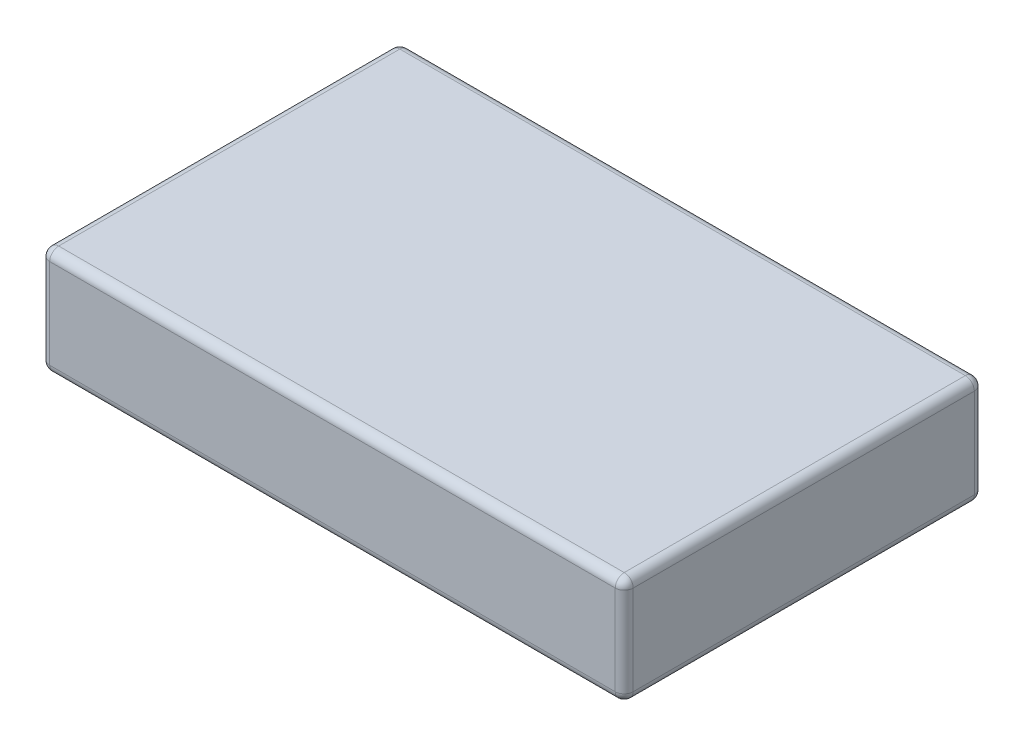
ISO-10303-21;
HEADER;
FILE_DESCRIPTION(('STEP AP214'),'2;1');
FILE_NAME('part.step','',(''),(''),'','','');
FILE_SCHEMA(('AUTOMOTIVE_DESIGN { 1 0 10303 214 1 1 1 1 }'));
ENDSEC;
DATA;
#1=APPLICATION_CONTEXT('core data for automotive mechanical design processes');
#2=APPLICATION_PROTOCOL_DEFINITION('international standard','automotive_design',2000,#1);
#3=PRODUCT_CONTEXT('',#1,'mechanical');
#4=PRODUCT('Part','Part','',(#3));
#5=PRODUCT_RELATED_PRODUCT_CATEGORY('part','',(#4));
#6=PRODUCT_DEFINITION_FORMATION('','',#4);
#7=PRODUCT_DEFINITION_CONTEXT('part definition',#1,'design');
#8=PRODUCT_DEFINITION('design','',#6,#7);
#9=PRODUCT_DEFINITION_SHAPE('','',#8);
#10=(LENGTH_UNIT() NAMED_UNIT(*) SI_UNIT(.MILLI.,.METRE.));
#11=(NAMED_UNIT(*) PLANE_ANGLE_UNIT() SI_UNIT($,.RADIAN.));
#12=(NAMED_UNIT(*) SI_UNIT($,.STERADIAN.) SOLID_ANGLE_UNIT());
#13=UNCERTAINTY_MEASURE_WITH_UNIT(LENGTH_MEASURE(1.E-05),#10,'distance_accuracy_value','');
#14=(GEOMETRIC_REPRESENTATION_CONTEXT(3) GLOBAL_UNCERTAINTY_ASSIGNED_CONTEXT((#13)) GLOBAL_UNIT_ASSIGNED_CONTEXT((#10,
#11,#12)) REPRESENTATION_CONTEXT('',''));
#15=CARTESIAN_POINT('',(0.,0.,0.));
#16=DIRECTION('',(0.,0.,1.));
#17=DIRECTION('',(1.,0.,0.));
#18=AXIS2_PLACEMENT_3D('',#15,#16,#17);
#19=CARTESIAN_POINT('',(0.,12.,0.));
#20=DIRECTION('',(1.,0.,0.));
#21=DIRECTION('',(0.,0.,-1.));
#22=AXIS2_PLACEMENT_3D('',#19,#20,#21);
#23=PLANE('',#22);
#24=DIRECTION('',(0.,-1.,0.));
#25=VECTOR('',#24,1.);
#26=CARTESIAN_POINT('',(0.,12.,-39.));
#27=LINE('',#26,#25);
#28=CARTESIAN_POINT('',(0.,11.,-39.));
#29=VERTEX_POINT('',#28);
#30=CARTESIAN_POINT('',(0.,1.,-39.));
#31=VERTEX_POINT('',#30);
#32=EDGE_CURVE('E159',#29,#31,#27,.T.);
#33=ORIENTED_EDGE('',*,*,#32,.T.);
#34=DIRECTION('',(0.,0.,1.));
#35=VECTOR('',#34,1.);
#36=CARTESIAN_POINT('',(0.,1.,0.));
#37=LINE('',#36,#35);
#38=CARTESIAN_POINT('',(0.,1.,-1.));
#39=VERTEX_POINT('',#38);
#40=EDGE_CURVE('E132',#31,#39,#37,.T.);
#41=ORIENTED_EDGE('',*,*,#40,.T.);
#42=DIRECTION('',(0.,-1.,0.));
#43=VECTOR('',#42,1.);
#44=CARTESIAN_POINT('',(0.,12.,-1.));
#45=LINE('',#44,#43);
#46=CARTESIAN_POINT('',(0.,11.,-1.));
#47=VERTEX_POINT('',#46);
#48=EDGE_CURVE('E150',#39,#47,#45,.F.);
#49=ORIENTED_EDGE('',*,*,#48,.T.);
#50=DIRECTION('',(0.,0.,1.));
#51=VECTOR('',#50,1.);
#52=CARTESIAN_POINT('',(0.,11.,0.));
#53=LINE('',#52,#51);
#54=EDGE_CURVE('E156',#47,#29,#53,.F.);
#55=ORIENTED_EDGE('',*,*,#54,.T.);
#56=EDGE_LOOP('',(#33,#41,#49,#55));
#57=FACE_BOUND('',#56,.T.);
#58=ADVANCED_FACE('F38',(#57),#23,.F.);
#59=CARTESIAN_POINT('',(0.,12.,0.));
#60=DIRECTION('',(0.,0.,-1.));
#61=DIRECTION('',(-1.,0.,0.));
#62=AXIS2_PLACEMENT_3D('',#59,#60,#61);
#63=PLANE('',#62);
#64=DIRECTION('',(1.,0.,0.));
#65=VECTOR('',#64,1.);
#66=CARTESIAN_POINT('',(0.,11.,0.));
#67=LINE('',#66,#65);
#68=CARTESIAN_POINT('',(64.,11.,0.));
#69=VERTEX_POINT('',#68);
#70=CARTESIAN_POINT('',(1.,11.,0.));
#71=VERTEX_POINT('',#70);
#72=EDGE_CURVE('E47',#69,#71,#67,.F.);
#73=ORIENTED_EDGE('',*,*,#72,.T.);
#74=DIRECTION('',(0.,-1.,0.));
#75=VECTOR('',#74,1.);
#76=CARTESIAN_POINT('',(1.,12.,0.));
#77=LINE('',#76,#75);
#78=CARTESIAN_POINT('',(1.,1.,0.));
#79=VERTEX_POINT('',#78);
#80=EDGE_CURVE('E11',#71,#79,#77,.T.);
#81=ORIENTED_EDGE('',*,*,#80,.T.);
#82=DIRECTION('',(1.,0.,0.));
#83=VECTOR('',#82,1.);
#84=CARTESIAN_POINT('',(65.,1.,0.));
#85=LINE('',#84,#83);
#86=CARTESIAN_POINT('',(64.,1.,0.));
#87=VERTEX_POINT('',#86);
#88=EDGE_CURVE('E199',#79,#87,#85,.T.);
#89=ORIENTED_EDGE('',*,*,#88,.T.);
#90=DIRECTION('',(0.,-1.,0.));
#91=VECTOR('',#90,1.);
#92=CARTESIAN_POINT('',(64.,12.,0.));
#93=LINE('',#92,#91);
#94=EDGE_CURVE('E58',#87,#69,#93,.F.);
#95=ORIENTED_EDGE('',*,*,#94,.T.);
#96=EDGE_LOOP('',(#73,#81,#89,#95));
#97=FACE_BOUND('',#96,.T.);
#98=ADVANCED_FACE('F314',(#97),#63,.F.);
#99=CARTESIAN_POINT('',(65.,12.,0.));
#100=DIRECTION('',(-1.,0.,0.));
#101=DIRECTION('',(0.,0.,1.));
#102=AXIS2_PLACEMENT_3D('',#99,#100,#101);
#103=PLANE('',#102);
#104=DIRECTION('',(0.,0.,-1.));
#105=VECTOR('',#104,1.);
#106=CARTESIAN_POINT('',(65.,1.,-40.));
#107=LINE('',#106,#105);
#108=CARTESIAN_POINT('',(65.,1.,-1.));
#109=VERTEX_POINT('',#108);
#110=CARTESIAN_POINT('',(65.,1.,-39.));
#111=VERTEX_POINT('',#110);
#112=EDGE_CURVE('E185',#109,#111,#107,.T.);
#113=ORIENTED_EDGE('',*,*,#112,.T.);
#114=DIRECTION('',(0.,-1.,0.));
#115=VECTOR('',#114,1.);
#116=CARTESIAN_POINT('',(65.,12.,-39.));
#117=LINE('',#116,#115);
#118=CARTESIAN_POINT('',(65.,11.,-39.));
#119=VERTEX_POINT('',#118);
#120=EDGE_CURVE('E187',#111,#119,#117,.F.);
#121=ORIENTED_EDGE('',*,*,#120,.T.);
#122=DIRECTION('',(0.,0.,-1.));
#123=VECTOR('',#122,1.);
#124=CARTESIAN_POINT('',(65.,11.,0.));
#125=LINE('',#124,#123);
#126=CARTESIAN_POINT('',(65.,11.,-1.));
#127=VERTEX_POINT('',#126);
#128=EDGE_CURVE('E183',#119,#127,#125,.F.);
#129=ORIENTED_EDGE('',*,*,#128,.T.);
#130=DIRECTION('',(0.,-1.,0.));
#131=VECTOR('',#130,1.);
#132=CARTESIAN_POINT('',(65.,12.,-1.));
#133=LINE('',#132,#131);
#134=EDGE_CURVE('E181',#127,#109,#133,.T.);
#135=ORIENTED_EDGE('',*,*,#134,.T.);
#136=EDGE_LOOP('',(#113,#121,#129,#135));
#137=FACE_BOUND('',#136,.T.);
#138=ADVANCED_FACE('F270',(#137),#103,.F.);
#139=CARTESIAN_POINT('',(0.,12.,-40.));
#140=DIRECTION('',(0.,0.,1.));
#141=DIRECTION('',(1.,0.,0.));
#142=AXIS2_PLACEMENT_3D('',#139,#140,#141);
#143=PLANE('',#142);
#144=DIRECTION('',(-1.,0.,0.));
#145=VECTOR('',#144,1.);
#146=CARTESIAN_POINT('',(0.,1.,-40.));
#147=LINE('',#146,#145);
#148=CARTESIAN_POINT('',(64.,1.,-40.));
#149=VERTEX_POINT('',#148);
#150=CARTESIAN_POINT('',(1.,1.,-40.));
#151=VERTEX_POINT('',#150);
#152=EDGE_CURVE('E176',#149,#151,#147,.T.);
#153=ORIENTED_EDGE('',*,*,#152,.T.);
#154=DIRECTION('',(0.,-1.,0.));
#155=VECTOR('',#154,1.);
#156=CARTESIAN_POINT('',(1.,12.,-40.));
#157=LINE('',#156,#155);
#158=CARTESIAN_POINT('',(1.,11.,-40.));
#159=VERTEX_POINT('',#158);
#160=EDGE_CURVE('E178',#151,#159,#157,.F.);
#161=ORIENTED_EDGE('',*,*,#160,.T.);
#162=DIRECTION('',(-1.,0.,0.));
#163=VECTOR('',#162,1.);
#164=CARTESIAN_POINT('',(0.,11.,-40.));
#165=LINE('',#164,#163);
#166=CARTESIAN_POINT('',(64.,11.,-40.));
#167=VERTEX_POINT('',#166);
#168=EDGE_CURVE('E172',#159,#167,#165,.F.);
#169=ORIENTED_EDGE('',*,*,#168,.T.);
#170=DIRECTION('',(0.,-1.,0.));
#171=VECTOR('',#170,1.);
#172=CARTESIAN_POINT('',(64.,12.,-40.));
#173=LINE('',#172,#171);
#174=EDGE_CURVE('E174',#167,#149,#173,.T.);
#175=ORIENTED_EDGE('',*,*,#174,.T.);
#176=EDGE_LOOP('',(#153,#161,#169,#175));
#177=FACE_BOUND('',#176,.T.);
#178=ADVANCED_FACE('F291',(#177),#143,.F.);
#179=CARTESIAN_POINT('',(0.,12.,0.));
#180=DIRECTION('',(0.,-1.,0.));
#181=DIRECTION('',(0.,0.,-1.));
#182=AXIS2_PLACEMENT_3D('',#179,#180,#181);
#183=PLANE('',#182);
#184=DIRECTION('',(0.,0.,-1.));
#185=VECTOR('',#184,1.);
#186=CARTESIAN_POINT('',(64.,12.,0.));
#187=LINE('',#186,#185);
#188=CARTESIAN_POINT('',(64.,12.,-1.));
#189=VERTEX_POINT('',#188);
#190=CARTESIAN_POINT('',(64.,12.,-39.));
#191=VERTEX_POINT('',#190);
#192=EDGE_CURVE('E194',#189,#191,#187,.T.);
#193=ORIENTED_EDGE('',*,*,#192,.T.);
#194=DIRECTION('',(-1.,0.,0.));
#195=VECTOR('',#194,1.);
#196=CARTESIAN_POINT('',(0.,12.,-39.));
#197=LINE('',#196,#195);
#198=CARTESIAN_POINT('',(1.,12.,-39.));
#199=VERTEX_POINT('',#198);
#200=EDGE_CURVE('E196',#191,#199,#197,.T.);
#201=ORIENTED_EDGE('',*,*,#200,.T.);
#202=DIRECTION('',(0.,0.,1.));
#203=VECTOR('',#202,1.);
#204=CARTESIAN_POINT('',(1.,12.,0.));
#205=LINE('',#204,#203);
#206=CARTESIAN_POINT('',(1.,12.,-1.));
#207=VERTEX_POINT('',#206);
#208=EDGE_CURVE('E192',#199,#207,#205,.T.);
#209=ORIENTED_EDGE('',*,*,#208,.T.);
#210=DIRECTION('',(1.,0.,0.));
#211=VECTOR('',#210,1.);
#212=CARTESIAN_POINT('',(0.,12.,-1.));
#213=LINE('',#212,#211);
#214=EDGE_CURVE('E190',#207,#189,#213,.T.);
#215=ORIENTED_EDGE('',*,*,#214,.T.);
#216=EDGE_LOOP('',(#193,#201,#209,#215));
#217=FACE_BOUND('',#216,.T.);
#218=ADVANCED_FACE('F305',(#217),#183,.F.);
#219=CARTESIAN_POINT('',(0.,0.,0.));
#220=DIRECTION('',(0.,-1.,0.));
#221=DIRECTION('',(0.,0.,-1.));
#222=AXIS2_PLACEMENT_3D('',#219,#220,#221);
#223=PLANE('',#222);
#224=DIRECTION('',(1.,0.,0.));
#225=VECTOR('',#224,1.);
#226=CARTESIAN_POINT('',(0.,0.,-1.));
#227=LINE('',#226,#225);
#228=CARTESIAN_POINT('',(64.,0.,-1.));
#229=VERTEX_POINT('',#228);
#230=CARTESIAN_POINT('',(1.,0.,-1.));
#231=VERTEX_POINT('',#230);
#232=EDGE_CURVE('E161',#229,#231,#227,.F.);
#233=ORIENTED_EDGE('',*,*,#232,.T.);
#234=DIRECTION('',(0.,0.,1.));
#235=VECTOR('',#234,1.);
#236=CARTESIAN_POINT('',(1.,0.,-40.));
#237=LINE('',#236,#235);
#238=CARTESIAN_POINT('',(1.,0.,-39.));
#239=VERTEX_POINT('',#238);
#240=EDGE_CURVE('E134',#231,#239,#237,.F.);
#241=ORIENTED_EDGE('',*,*,#240,.T.);
#242=DIRECTION('',(-1.,0.,0.));
#243=VECTOR('',#242,1.);
#244=CARTESIAN_POINT('',(65.,0.,-39.));
#245=LINE('',#244,#243);
#246=CARTESIAN_POINT('',(64.,0.,-39.));
#247=VERTEX_POINT('',#246);
#248=EDGE_CURVE('E169',#239,#247,#245,.F.);
#249=ORIENTED_EDGE('',*,*,#248,.T.);
#250=DIRECTION('',(0.,0.,-1.));
#251=VECTOR('',#250,1.);
#252=CARTESIAN_POINT('',(64.,0.,0.));
#253=LINE('',#252,#251);
#254=EDGE_CURVE('E163',#247,#229,#253,.F.);
#255=ORIENTED_EDGE('',*,*,#254,.T.);
#256=EDGE_LOOP('',(#233,#241,#249,#255));
#257=FACE_BOUND('',#256,.T.);
#258=ADVANCED_FACE('F325',(#257),#223,.T.);
#259=CARTESIAN_POINT('',(64.,11.,0.));
#260=DIRECTION('',(0.,0.,-1.));
#261=DIRECTION('',(-1.,0.,0.));
#262=AXIS2_PLACEMENT_3D('',#259,#260,#261);
#263=CYLINDRICAL_SURFACE('',#262,1.);
#264=CARTESIAN_POINT('',(64.,11.,-39.));
#265=DIRECTION('',(0.,0.,-1.));
#266=DIRECTION('',(-1.,0.,0.));
#267=AXIS2_PLACEMENT_3D('',#264,#265,#266);
#268=CIRCLE('',#267,1.);
#269=EDGE_CURVE('E42',#191,#119,#268,.T.);
#270=ORIENTED_EDGE('',*,*,#269,.F.);
#271=ORIENTED_EDGE('',*,*,#192,.F.);
#272=CARTESIAN_POINT('',(64.,11.,-1.));
#273=DIRECTION('',(0.,0.,1.));
#274=DIRECTION('',(1.,0.,0.));
#275=AXIS2_PLACEMENT_3D('',#272,#273,#274);
#276=CIRCLE('',#275,1.);
#277=EDGE_CURVE('E251',#127,#189,#276,.T.);
#278=ORIENTED_EDGE('',*,*,#277,.F.);
#279=ORIENTED_EDGE('',*,*,#128,.F.);
#280=EDGE_LOOP('',(#270,#271,#278,#279));
#281=FACE_BOUND('',#280,.T.);
#282=ADVANCED_FACE('F40',(#281),#263,.T.);
#283=CARTESIAN_POINT('',(64.,11.,-39.));
#284=DIRECTION('',(1.,0.,0.));
#285=DIRECTION('',(0.,0.,-1.));
#286=AXIS2_PLACEMENT_3D('',#283,#284,#285);
#287=SPHERICAL_SURFACE('',#286,1.);
#288=CARTESIAN_POINT('',(64.,11.,-39.));
#289=DIRECTION('',(1.,0.,0.));
#290=DIRECTION('',(0.,0.,-1.));
#291=AXIS2_PLACEMENT_3D('',#288,#289,#290);
#292=CIRCLE('',#291,1.);
#293=EDGE_CURVE('E247',#191,#167,#292,.F.);
#294=ORIENTED_EDGE('',*,*,#293,.F.);
#295=ORIENTED_EDGE('',*,*,#269,.T.);
#296=CARTESIAN_POINT('',(64.,11.,-39.));
#297=DIRECTION('',(0.,1.,0.));
#298=DIRECTION('',(0.,0.,1.));
#299=AXIS2_PLACEMENT_3D('',#296,#297,#298);
#300=CIRCLE('',#299,1.);
#301=EDGE_CURVE('E250',#167,#119,#300,.F.);
#302=ORIENTED_EDGE('',*,*,#301,.F.);
#303=EDGE_LOOP('',(#294,#295,#302));
#304=FACE_BOUND('',#303,.T.);
#305=ADVANCED_FACE('F263',(#304),#287,.T.);
#306=CARTESIAN_POINT('',(64.,11.,-1.));
#307=DIRECTION('',(0.,1.,0.));
#308=DIRECTION('',(0.,0.,1.));
#309=AXIS2_PLACEMENT_3D('',#306,#307,#308);
#310=SPHERICAL_SURFACE('',#309,1.);
#311=CARTESIAN_POINT('',(64.,11.,-1.));
#312=DIRECTION('',(0.,1.,0.));
#313=DIRECTION('',(0.,0.,1.));
#314=AXIS2_PLACEMENT_3D('',#311,#312,#313);
#315=CIRCLE('',#314,1.);
#316=EDGE_CURVE('E242',#127,#69,#315,.F.);
#317=ORIENTED_EDGE('',*,*,#316,.F.);
#318=ORIENTED_EDGE('',*,*,#277,.T.);
#319=CARTESIAN_POINT('',(64.,11.,-1.));
#320=DIRECTION('',(1.,0.,0.));
#321=DIRECTION('',(0.,0.,-1.));
#322=AXIS2_PLACEMENT_3D('',#319,#320,#321);
#323=CIRCLE('',#322,1.);
#324=EDGE_CURVE('E244',#69,#189,#323,.F.);
#325=ORIENTED_EDGE('',*,*,#324,.F.);
#326=EDGE_LOOP('',(#317,#318,#325));
#327=FACE_BOUND('',#326,.T.);
#328=ADVANCED_FACE('F378',(#327),#310,.T.);
#329=CARTESIAN_POINT('',(64.,12.,-39.));
#330=DIRECTION('',(0.,-1.,0.));
#331=DIRECTION('',(0.,0.,-1.));
#332=AXIS2_PLACEMENT_3D('',#329,#330,#331);
#333=CYLINDRICAL_SURFACE('',#332,1.);
#334=ORIENTED_EDGE('',*,*,#301,.T.);
#335=ORIENTED_EDGE('',*,*,#120,.F.);
#336=CARTESIAN_POINT('',(64.,1.,-39.));
#337=DIRECTION('',(0.,-1.,0.));
#338=DIRECTION('',(0.,0.,-1.));
#339=AXIS2_PLACEMENT_3D('',#336,#337,#338);
#340=CIRCLE('',#339,1.);
#341=EDGE_CURVE('E236',#149,#111,#340,.T.);
#342=ORIENTED_EDGE('',*,*,#341,.F.);
#343=ORIENTED_EDGE('',*,*,#174,.F.);
#344=EDGE_LOOP('',(#334,#335,#342,#343));
#345=FACE_BOUND('',#344,.T.);
#346=ADVANCED_FACE('F275',(#345),#333,.T.);
#347=CARTESIAN_POINT('',(0.,11.,-39.));
#348=DIRECTION('',(-1.,0.,0.));
#349=DIRECTION('',(0.,0.,1.));
#350=AXIS2_PLACEMENT_3D('',#347,#348,#349);
#351=CYLINDRICAL_SURFACE('',#350,1.);
#352=ORIENTED_EDGE('',*,*,#293,.T.);
#353=ORIENTED_EDGE('',*,*,#168,.F.);
#354=CARTESIAN_POINT('',(1.,11.,-39.));
#355=DIRECTION('',(-1.,0.,0.));
#356=DIRECTION('',(0.,0.,1.));
#357=AXIS2_PLACEMENT_3D('',#354,#355,#356);
#358=CIRCLE('',#357,1.);
#359=EDGE_CURVE('E233',#199,#159,#358,.T.);
#360=ORIENTED_EDGE('',*,*,#359,.F.);
#361=ORIENTED_EDGE('',*,*,#200,.F.);
#362=EDGE_LOOP('',(#352,#353,#360,#361));
#363=FACE_BOUND('',#362,.T.);
#364=ADVANCED_FACE('F303',(#363),#351,.T.);
#365=CARTESIAN_POINT('',(1.,11.,0.));
#366=DIRECTION('',(0.,0.,1.));
#367=DIRECTION('',(1.,0.,0.));
#368=AXIS2_PLACEMENT_3D('',#365,#366,#367);
#369=CYLINDRICAL_SURFACE('',#368,1.);
#370=CARTESIAN_POINT('',(1.,11.,-1.));
#371=DIRECTION('',(0.,0.,1.));
#372=DIRECTION('',(1.,0.,0.));
#373=AXIS2_PLACEMENT_3D('',#370,#371,#372);
#374=CIRCLE('',#373,1.);
#375=EDGE_CURVE('E228',#207,#47,#374,.T.);
#376=ORIENTED_EDGE('',*,*,#375,.F.);
#377=ORIENTED_EDGE('',*,*,#208,.F.);
#378=CARTESIAN_POINT('',(1.,11.,-39.));
#379=DIRECTION('',(0.,0.,-1.));
#380=DIRECTION('',(-1.,0.,0.));
#381=AXIS2_PLACEMENT_3D('',#378,#379,#380);
#382=CIRCLE('',#381,1.);
#383=EDGE_CURVE('E231',#29,#199,#382,.T.);
#384=ORIENTED_EDGE('',*,*,#383,.F.);
#385=ORIENTED_EDGE('',*,*,#54,.F.);
#386=EDGE_LOOP('',(#376,#377,#384,#385));
#387=FACE_BOUND('',#386,.T.);
#388=ADVANCED_FACE('F311',(#387),#369,.T.);
#389=CARTESIAN_POINT('',(0.,11.,-1.));
#390=DIRECTION('',(1.,0.,0.));
#391=DIRECTION('',(0.,0.,-1.));
#392=AXIS2_PLACEMENT_3D('',#389,#390,#391);
#393=CYLINDRICAL_SURFACE('',#392,1.);
#394=ORIENTED_EDGE('',*,*,#324,.T.);
#395=ORIENTED_EDGE('',*,*,#214,.F.);
#396=CARTESIAN_POINT('',(1.,11.,-1.));
#397=DIRECTION('',(-1.,0.,0.));
#398=DIRECTION('',(0.,0.,1.));
#399=AXIS2_PLACEMENT_3D('',#396,#397,#398);
#400=CIRCLE('',#399,1.);
#401=EDGE_CURVE('E225',#71,#207,#400,.T.);
#402=ORIENTED_EDGE('',*,*,#401,.F.);
#403=ORIENTED_EDGE('',*,*,#72,.F.);
#404=EDGE_LOOP('',(#394,#395,#402,#403));
#405=FACE_BOUND('',#404,.T.);
#406=ADVANCED_FACE('F309',(#405),#393,.T.);
#407=CARTESIAN_POINT('',(64.,12.,-1.));
#408=DIRECTION('',(0.,-1.,0.));
#409=DIRECTION('',(0.,0.,-1.));
#410=AXIS2_PLACEMENT_3D('',#407,#408,#409);
#411=CYLINDRICAL_SURFACE('',#410,1.);
#412=ORIENTED_EDGE('',*,*,#316,.T.);
#413=ORIENTED_EDGE('',*,*,#94,.F.);
#414=CARTESIAN_POINT('',(64.,1.,-1.));
#415=DIRECTION('',(0.,-1.,0.));
#416=DIRECTION('',(0.,0.,-1.));
#417=AXIS2_PLACEMENT_3D('',#414,#415,#416);
#418=CIRCLE('',#417,1.);
#419=EDGE_CURVE('E222',#109,#87,#418,.T.);
#420=ORIENTED_EDGE('',*,*,#419,.F.);
#421=ORIENTED_EDGE('',*,*,#134,.F.);
#422=EDGE_LOOP('',(#412,#413,#420,#421));
#423=FACE_BOUND('',#422,.T.);
#424=ADVANCED_FACE('F317',(#423),#411,.T.);
#425=CARTESIAN_POINT('',(64.,1.,0.));
#426=DIRECTION('',(0.,0.,1.));
#427=DIRECTION('',(1.,0.,0.));
#428=AXIS2_PLACEMENT_3D('',#425,#426,#427);
#429=CYLINDRICAL_SURFACE('',#428,1.);
#430=CARTESIAN_POINT('',(64.,1.,-39.));
#431=DIRECTION('',(0.,0.,-1.));
#432=DIRECTION('',(-1.,0.,0.));
#433=AXIS2_PLACEMENT_3D('',#430,#431,#432);
#434=CIRCLE('',#433,1.);
#435=EDGE_CURVE('E239',#111,#247,#434,.T.);
#436=ORIENTED_EDGE('',*,*,#435,.F.);
#437=ORIENTED_EDGE('',*,*,#112,.F.);
#438=CARTESIAN_POINT('',(64.,1.,-1.));
#439=DIRECTION('',(0.,0.,1.));
#440=DIRECTION('',(1.,0.,0.));
#441=AXIS2_PLACEMENT_3D('',#438,#439,#440);
#442=CIRCLE('',#441,1.);
#443=EDGE_CURVE('E219',#229,#109,#442,.T.);
#444=ORIENTED_EDGE('',*,*,#443,.F.);
#445=ORIENTED_EDGE('',*,*,#254,.F.);
#446=EDGE_LOOP('',(#436,#437,#444,#445));
#447=FACE_BOUND('',#446,.T.);
#448=ADVANCED_FACE('F279',(#447),#429,.T.);
#449=CARTESIAN_POINT('',(64.,1.,-39.));
#450=DIRECTION('',(1.,0.,0.));
#451=DIRECTION('',(0.,1.,0.));
#452=AXIS2_PLACEMENT_3D('',#449,#450,#451);
#453=SPHERICAL_SURFACE('',#452,1.);
#454=ORIENTED_EDGE('',*,*,#341,.T.);
#455=ORIENTED_EDGE('',*,*,#435,.T.);
#456=CARTESIAN_POINT('',(64.,1.,-39.));
#457=DIRECTION('',(1.,0.,0.));
#458=DIRECTION('',(0.,0.,-1.));
#459=AXIS2_PLACEMENT_3D('',#456,#457,#458);
#460=CIRCLE('',#459,1.);
#461=EDGE_CURVE('E216',#149,#247,#460,.F.);
#462=ORIENTED_EDGE('',*,*,#461,.F.);
#463=EDGE_LOOP('',(#454,#455,#462));
#464=FACE_BOUND('',#463,.T.);
#465=ADVANCED_FACE('F283',(#464),#453,.T.);
#466=CARTESIAN_POINT('',(1.,11.,-39.));
#467=DIRECTION('',(0.,1.,0.));
#468=DIRECTION('',(0.,0.,1.));
#469=AXIS2_PLACEMENT_3D('',#466,#467,#468);
#470=SPHERICAL_SURFACE('',#469,1.);
#471=ORIENTED_EDGE('',*,*,#383,.T.);
#472=ORIENTED_EDGE('',*,*,#359,.T.);
#473=CARTESIAN_POINT('',(1.,11.,-39.));
#474=DIRECTION('',(0.,1.,0.));
#475=DIRECTION('',(0.,0.,1.));
#476=AXIS2_PLACEMENT_3D('',#473,#474,#475);
#477=CIRCLE('',#476,1.);
#478=EDGE_CURVE('E214',#29,#159,#477,.F.);
#479=ORIENTED_EDGE('',*,*,#478,.F.);
#480=EDGE_LOOP('',(#471,#472,#479));
#481=FACE_BOUND('',#480,.T.);
#482=ADVANCED_FACE('F299',(#481),#470,.T.);
#483=CARTESIAN_POINT('',(1.,11.,-1.));
#484=DIRECTION('',(0.,1.,0.));
#485=DIRECTION('',(0.,0.,1.));
#486=AXIS2_PLACEMENT_3D('',#483,#484,#485);
#487=SPHERICAL_SURFACE('',#486,1.);
#488=ORIENTED_EDGE('',*,*,#401,.T.);
#489=ORIENTED_EDGE('',*,*,#375,.T.);
#490=CARTESIAN_POINT('',(1.,11.,-1.));
#491=DIRECTION('',(0.,1.,0.));
#492=DIRECTION('',(0.,0.,1.));
#493=AXIS2_PLACEMENT_3D('',#490,#491,#492);
#494=CIRCLE('',#493,1.);
#495=EDGE_CURVE('E153',#71,#47,#494,.F.);
#496=ORIENTED_EDGE('',*,*,#495,.F.);
#497=EDGE_LOOP('',(#488,#489,#496));
#498=FACE_BOUND('',#497,.T.);
#499=ADVANCED_FACE('F313',(#498),#487,.T.);
#500=CARTESIAN_POINT('',(64.,1.,-1.));
#501=DIRECTION('',(1.,0.,0.));
#502=DIRECTION('',(0.,1.,0.));
#503=AXIS2_PLACEMENT_3D('',#500,#501,#502);
#504=SPHERICAL_SURFACE('',#503,1.);
#505=ORIENTED_EDGE('',*,*,#443,.T.);
#506=ORIENTED_EDGE('',*,*,#419,.T.);
#507=CARTESIAN_POINT('',(64.,1.,-1.));
#508=DIRECTION('',(1.,0.,0.));
#509=DIRECTION('',(0.,0.,-1.));
#510=AXIS2_PLACEMENT_3D('',#507,#508,#509);
#511=CIRCLE('',#510,1.);
#512=EDGE_CURVE('E210',#229,#87,#511,.F.);
#513=ORIENTED_EDGE('',*,*,#512,.F.);
#514=EDGE_LOOP('',(#505,#506,#513));
#515=FACE_BOUND('',#514,.T.);
#516=ADVANCED_FACE('F321',(#515),#504,.T.);
#517=CARTESIAN_POINT('',(0.,1.,-39.));
#518=DIRECTION('',(1.,0.,0.));
#519=DIRECTION('',(0.,0.,-1.));
#520=AXIS2_PLACEMENT_3D('',#517,#518,#519);
#521=CYLINDRICAL_SURFACE('',#520,1.);
#522=ORIENTED_EDGE('',*,*,#461,.T.);
#523=ORIENTED_EDGE('',*,*,#248,.F.);
#524=CARTESIAN_POINT('',(1.,1.,-39.));
#525=DIRECTION('',(-1.,0.,0.));
#526=DIRECTION('',(0.,0.,1.));
#527=AXIS2_PLACEMENT_3D('',#524,#525,#526);
#528=CIRCLE('',#527,1.);
#529=EDGE_CURVE('E207',#151,#239,#528,.T.);
#530=ORIENTED_EDGE('',*,*,#529,.F.);
#531=ORIENTED_EDGE('',*,*,#152,.F.);
#532=EDGE_LOOP('',(#522,#523,#530,#531));
#533=FACE_BOUND('',#532,.T.);
#534=ADVANCED_FACE('F288',(#533),#521,.T.);
#535=CARTESIAN_POINT('',(1.,12.,-39.));
#536=DIRECTION('',(0.,-1.,0.));
#537=DIRECTION('',(0.,0.,-1.));
#538=AXIS2_PLACEMENT_3D('',#535,#536,#537);
#539=CYLINDRICAL_SURFACE('',#538,1.);
#540=ORIENTED_EDGE('',*,*,#478,.T.);
#541=ORIENTED_EDGE('',*,*,#160,.F.);
#542=CARTESIAN_POINT('',(1.,1.,-39.));
#543=DIRECTION('',(0.,-1.,0.));
#544=DIRECTION('',(0.,0.,-1.));
#545=AXIS2_PLACEMENT_3D('',#542,#543,#544);
#546=CIRCLE('',#545,1.);
#547=EDGE_CURVE('E147',#31,#151,#546,.T.);
#548=ORIENTED_EDGE('',*,*,#547,.F.);
#549=ORIENTED_EDGE('',*,*,#32,.F.);
#550=EDGE_LOOP('',(#540,#541,#548,#549));
#551=FACE_BOUND('',#550,.T.);
#552=ADVANCED_FACE('F293',(#551),#539,.T.);
#553=CARTESIAN_POINT('',(1.,12.,-1.));
#554=DIRECTION('',(0.,-1.,0.));
#555=DIRECTION('',(0.,0.,-1.));
#556=AXIS2_PLACEMENT_3D('',#553,#554,#555);
#557=CYLINDRICAL_SURFACE('',#556,1.);
#558=ORIENTED_EDGE('',*,*,#495,.T.);
#559=ORIENTED_EDGE('',*,*,#48,.F.);
#560=CARTESIAN_POINT('',(1.,1.,-1.));
#561=DIRECTION('',(0.,-1.,0.));
#562=DIRECTION('',(0.,0.,-1.));
#563=AXIS2_PLACEMENT_3D('',#560,#561,#562);
#564=CIRCLE('',#563,1.);
#565=EDGE_CURVE('E139',#79,#39,#564,.T.);
#566=ORIENTED_EDGE('',*,*,#565,.F.);
#567=ORIENTED_EDGE('',*,*,#80,.F.);
#568=EDGE_LOOP('',(#558,#559,#566,#567));
#569=FACE_BOUND('',#568,.T.);
#570=ADVANCED_FACE('F151',(#569),#557,.T.);
#571=CARTESIAN_POINT('',(0.,1.,-1.));
#572=DIRECTION('',(-1.,0.,0.));
#573=DIRECTION('',(0.,0.,1.));
#574=AXIS2_PLACEMENT_3D('',#571,#572,#573);
#575=CYLINDRICAL_SURFACE('',#574,1.);
#576=ORIENTED_EDGE('',*,*,#512,.T.);
#577=ORIENTED_EDGE('',*,*,#88,.F.);
#578=CARTESIAN_POINT('',(1.,1.,-1.));
#579=DIRECTION('',(-1.,0.,0.));
#580=DIRECTION('',(0.,0.,1.));
#581=AXIS2_PLACEMENT_3D('',#578,#579,#580);
#582=CIRCLE('',#581,1.);
#583=EDGE_CURVE('E143',#231,#79,#582,.T.);
#584=ORIENTED_EDGE('',*,*,#583,.F.);
#585=ORIENTED_EDGE('',*,*,#232,.F.);
#586=EDGE_LOOP('',(#576,#577,#584,#585));
#587=FACE_BOUND('',#586,.T.);
#588=ADVANCED_FACE('F323',(#587),#575,.T.);
#589=CARTESIAN_POINT('',(1.,1.,-39.));
#590=DIRECTION('',(0.,0.,-1.));
#591=DIRECTION('',(0.,1.,0.));
#592=AXIS2_PLACEMENT_3D('',#589,#590,#591);
#593=SPHERICAL_SURFACE('',#592,1.);
#594=ORIENTED_EDGE('',*,*,#547,.T.);
#595=ORIENTED_EDGE('',*,*,#529,.T.);
#596=CARTESIAN_POINT('',(1.,1.,-39.));
#597=DIRECTION('',(0.,0.,-1.));
#598=DIRECTION('',(-1.,0.,0.));
#599=AXIS2_PLACEMENT_3D('',#596,#597,#598);
#600=CIRCLE('',#599,1.);
#601=EDGE_CURVE('E136',#31,#239,#600,.F.);
#602=ORIENTED_EDGE('',*,*,#601,.F.);
#603=EDGE_LOOP('',(#594,#595,#602));
#604=FACE_BOUND('',#603,.T.);
#605=ADVANCED_FACE('F346',(#604),#593,.T.);
#606=CARTESIAN_POINT('',(1.,1.,-1.));
#607=DIRECTION('',(0.,0.,1.));
#608=DIRECTION('',(0.,-1.,0.));
#609=AXIS2_PLACEMENT_3D('',#606,#607,#608);
#610=SPHERICAL_SURFACE('',#609,1.);
#611=ORIENTED_EDGE('',*,*,#583,.T.);
#612=ORIENTED_EDGE('',*,*,#565,.T.);
#613=CARTESIAN_POINT('',(1.,1.,-1.));
#614=DIRECTION('',(0.,0.,1.));
#615=DIRECTION('',(1.,0.,0.));
#616=AXIS2_PLACEMENT_3D('',#613,#614,#615);
#617=CIRCLE('',#616,1.);
#618=EDGE_CURVE('E128',#231,#39,#617,.F.);
#619=ORIENTED_EDGE('',*,*,#618,.F.);
#620=EDGE_LOOP('',(#611,#612,#619));
#621=FACE_BOUND('',#620,.T.);
#622=ADVANCED_FACE('F141',(#621),#610,.T.);
#623=CARTESIAN_POINT('',(1.,1.,0.));
#624=DIRECTION('',(0.,0.,-1.));
#625=DIRECTION('',(-1.,0.,0.));
#626=AXIS2_PLACEMENT_3D('',#623,#624,#625);
#627=CYLINDRICAL_SURFACE('',#626,1.);
#628=ORIENTED_EDGE('',*,*,#601,.T.);
#629=ORIENTED_EDGE('',*,*,#240,.F.);
#630=ORIENTED_EDGE('',*,*,#618,.T.);
#631=ORIENTED_EDGE('',*,*,#40,.F.);
#632=EDGE_LOOP('',(#628,#629,#630,#631));
#633=FACE_BOUND('',#632,.T.);
#634=ADVANCED_FACE('F130',(#633),#627,.T.);
#635=CLOSED_SHELL('',(#58,#98,#138,#178,#218,#258,#282,#305,#328,#346,#364,#388,#406,#424,#448,
#465,#482,#499,#516,#534,#552,#570,#588,#605,#622,#634));
#636=MANIFOLD_SOLID_BREP('B2',#635);
#637=ADVANCED_BREP_SHAPE_REPRESENTATION('',(#18,#636),#14);
#638=SHAPE_DEFINITION_REPRESENTATION(#9,#637);
ENDSEC;
END-ISO-10303-21;
